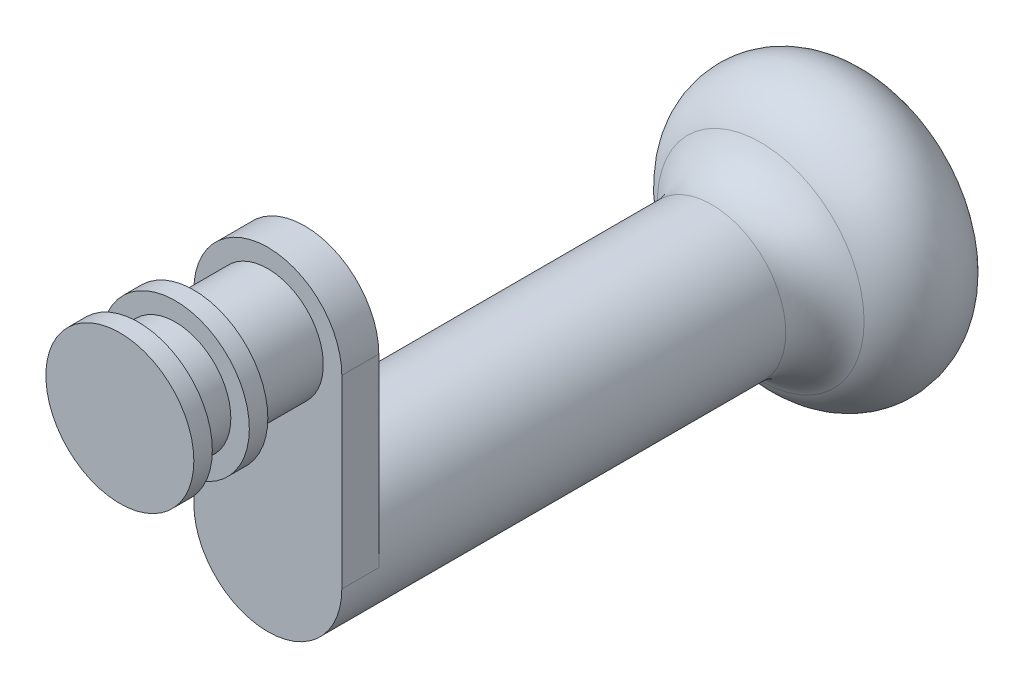
ISO-10303-21;
HEADER;
FILE_DESCRIPTION(('STEP AP214'),'2;1');
FILE_NAME('part.step','',(''),(''),'','','');
FILE_SCHEMA(('AUTOMOTIVE_DESIGN { 1 0 10303 214 1 1 1 1 }'));
ENDSEC;
DATA;
#1=APPLICATION_CONTEXT('core data for automotive mechanical design processes');
#2=APPLICATION_PROTOCOL_DEFINITION('international standard','automotive_design',2000,#1);
#3=PRODUCT_CONTEXT('',#1,'mechanical');
#4=PRODUCT('Part','Part','',(#3));
#5=PRODUCT_RELATED_PRODUCT_CATEGORY('part','',(#4));
#6=PRODUCT_DEFINITION_FORMATION('','',#4);
#7=PRODUCT_DEFINITION_CONTEXT('part definition',#1,'design');
#8=PRODUCT_DEFINITION('design','',#6,#7);
#9=PRODUCT_DEFINITION_SHAPE('','',#8);
#10=(LENGTH_UNIT() NAMED_UNIT(*) SI_UNIT(.MILLI.,.METRE.));
#11=(NAMED_UNIT(*) PLANE_ANGLE_UNIT() SI_UNIT($,.RADIAN.));
#12=(NAMED_UNIT(*) SI_UNIT($,.STERADIAN.) SOLID_ANGLE_UNIT());
#13=UNCERTAINTY_MEASURE_WITH_UNIT(LENGTH_MEASURE(1.E-05),#10,'distance_accuracy_value','');
#14=(GEOMETRIC_REPRESENTATION_CONTEXT(3) GLOBAL_UNCERTAINTY_ASSIGNED_CONTEXT((#13)) GLOBAL_UNIT_ASSIGNED_CONTEXT((#10,
#11,#12)) REPRESENTATION_CONTEXT('',''));
#15=CARTESIAN_POINT('',(0.,0.,0.));
#16=DIRECTION('',(0.,0.,1.));
#17=DIRECTION('',(1.,0.,0.));
#18=AXIS2_PLACEMENT_3D('',#15,#16,#17);
#19=CARTESIAN_POINT('',(0.,0.,25.));
#20=DIRECTION('',(0.,0.,-1.));
#21=DIRECTION('',(-1.,0.,0.));
#22=AXIS2_PLACEMENT_3D('',#19,#20,#21);
#23=CYLINDRICAL_SURFACE('',#22,7.5);
#24=CARTESIAN_POINT('',(0.,0.,15.));
#25=DIRECTION('',(0.,0.,1.));
#26=DIRECTION('',(1.,0.,0.));
#27=AXIS2_PLACEMENT_3D('',#24,#25,#26);
#28=CIRCLE('',#27,7.5);
#29=CARTESIAN_POINT('',(7.5,0.,15.));
#30=VERTEX_POINT('',#29);
#31=EDGE_CURVE('E122',#30,#30,#28,.T.);
#32=ORIENTED_EDGE('',*,*,#31,.F.);
#33=EDGE_LOOP('',(#32));
#34=FACE_BOUND('',#33,.T.);
#35=CARTESIAN_POINT('',(0.,0.,5.));
#36=DIRECTION('',(0.,0.,-1.));
#37=DIRECTION('',(-1.,0.,0.));
#38=AXIS2_PLACEMENT_3D('',#35,#36,#37);
#39=CIRCLE('',#38,7.5);
#40=CARTESIAN_POINT('',(-7.5,0.,5.));
#41=VERTEX_POINT('',#40);
#42=EDGE_CURVE('E41',#41,#41,#39,.T.);
#43=ORIENTED_EDGE('',*,*,#42,.F.);
#44=EDGE_LOOP('',(#43));
#45=FACE_BOUND('',#44,.T.);
#46=ADVANCED_FACE('F32',(#34,#45),#23,.T.);
#47=CARTESIAN_POINT('',(0.,0.,17.5));
#48=DIRECTION('',(0.,0.,1.));
#49=DIRECTION('',(1.,0.,0.));
#50=AXIS2_PLACEMENT_3D('',#47,#48,#49);
#51=CIRCLE('',#50,7.5);
#52=CARTESIAN_POINT('',(7.5,0.,17.5));
#53=VERTEX_POINT('',#52);
#54=EDGE_CURVE('E110',#53,#53,#51,.T.);
#55=ORIENTED_EDGE('',*,*,#54,.T.);
#56=EDGE_LOOP('',(#55));
#57=FACE_BOUND('',#56,.T.);
#58=CARTESIAN_POINT('',(0.,0.,22.5));
#59=DIRECTION('',(0.,0.,1.));
#60=DIRECTION('',(1.,0.,0.));
#61=AXIS2_PLACEMENT_3D('',#58,#59,#60);
#62=CIRCLE('',#61,7.5);
#63=CARTESIAN_POINT('',(7.5,0.,22.5));
#64=VERTEX_POINT('',#63);
#65=EDGE_CURVE('E116',#64,#64,#62,.T.);
#66=ORIENTED_EDGE('',*,*,#65,.F.);
#67=EDGE_LOOP('',(#66));
#68=FACE_BOUND('',#67,.T.);
#69=ADVANCED_FACE('F34',(#57,#68),#23,.T.);
#70=CARTESIAN_POINT('',(0.,0.,22.5));
#71=DIRECTION('',(0.,0.,1.));
#72=DIRECTION('',(1.,0.,0.));
#73=AXIS2_PLACEMENT_3D('',#70,#71,#72);
#74=CYLINDRICAL_SURFACE('',#73,10.);
#75=CARTESIAN_POINT('',(0.,0.,22.5));
#76=DIRECTION('',(0.,0.,1.));
#77=DIRECTION('',(1.,0.,0.));
#78=AXIS2_PLACEMENT_3D('',#75,#76,#77);
#79=CIRCLE('',#78,10.);
#80=CARTESIAN_POINT('',(10.,0.,22.5));
#81=VERTEX_POINT('',#80);
#82=EDGE_CURVE('E113',#81,#81,#79,.T.);
#83=ORIENTED_EDGE('',*,*,#82,.T.);
#84=EDGE_LOOP('',(#83));
#85=FACE_BOUND('',#84,.T.);
#86=CARTESIAN_POINT('',(0.,0.,25.));
#87=DIRECTION('',(0.,0.,1.));
#88=DIRECTION('',(1.,0.,0.));
#89=AXIS2_PLACEMENT_3D('',#86,#87,#88);
#90=CIRCLE('',#89,10.);
#91=CARTESIAN_POINT('',(10.,0.,25.));
#92=VERTEX_POINT('',#91);
#93=EDGE_CURVE('E117',#92,#92,#90,.T.);
#94=ORIENTED_EDGE('',*,*,#93,.F.);
#95=EDGE_LOOP('',(#94));
#96=FACE_BOUND('',#95,.T.);
#97=ADVANCED_FACE('F137',(#85,#96),#74,.T.);
#98=CARTESIAN_POINT('',(0.,0.,22.5));
#99=DIRECTION('',(0.,0.,1.));
#100=DIRECTION('',(1.,0.,0.));
#101=AXIS2_PLACEMENT_3D('',#98,#99,#100);
#102=PLANE('',#101);
#103=ORIENTED_EDGE('',*,*,#65,.T.);
#104=EDGE_LOOP('',(#103));
#105=FACE_BOUND('',#104,.T.);
#106=ORIENTED_EDGE('',*,*,#82,.F.);
#107=EDGE_LOOP('',(#106));
#108=FACE_BOUND('',#107,.T.);
#109=ADVANCED_FACE('F165',(#105,#108),#102,.F.);
#110=CARTESIAN_POINT('',(0.,0.,25.));
#111=DIRECTION('',(0.,0.,1.));
#112=DIRECTION('',(1.,0.,0.));
#113=AXIS2_PLACEMENT_3D('',#110,#111,#112);
#114=PLANE('',#113);
#115=ORIENTED_EDGE('',*,*,#93,.T.);
#116=EDGE_LOOP('',(#115));
#117=FACE_BOUND('',#116,.T.);
#118=ADVANCED_FACE('F151',(#117),#114,.T.);
#119=CARTESIAN_POINT('',(0.,0.,15.));
#120=DIRECTION('',(0.,0.,1.));
#121=DIRECTION('',(1.,0.,0.));
#122=AXIS2_PLACEMENT_3D('',#119,#120,#121);
#123=CYLINDRICAL_SURFACE('',#122,10.);
#124=CARTESIAN_POINT('',(0.,0.,15.));
#125=DIRECTION('',(0.,0.,1.));
#126=DIRECTION('',(1.,0.,0.));
#127=AXIS2_PLACEMENT_3D('',#124,#125,#126);
#128=CIRCLE('',#127,10.);
#129=CARTESIAN_POINT('',(10.,0.,15.));
#130=VERTEX_POINT('',#129);
#131=EDGE_CURVE('E107',#130,#130,#128,.T.);
#132=ORIENTED_EDGE('',*,*,#131,.T.);
#133=EDGE_LOOP('',(#132));
#134=FACE_BOUND('',#133,.T.);
#135=CARTESIAN_POINT('',(0.,0.,17.5));
#136=DIRECTION('',(0.,0.,1.));
#137=DIRECTION('',(1.,0.,0.));
#138=AXIS2_PLACEMENT_3D('',#135,#136,#137);
#139=CIRCLE('',#138,10.);
#140=CARTESIAN_POINT('',(10.,0.,17.5));
#141=VERTEX_POINT('',#140);
#142=EDGE_CURVE('E102',#141,#141,#139,.T.);
#143=ORIENTED_EDGE('',*,*,#142,.F.);
#144=EDGE_LOOP('',(#143));
#145=FACE_BOUND('',#144,.T.);
#146=ADVANCED_FACE('F145',(#134,#145),#123,.T.);
#147=CARTESIAN_POINT('',(0.,0.,15.));
#148=DIRECTION('',(0.,0.,1.));
#149=DIRECTION('',(1.,0.,0.));
#150=AXIS2_PLACEMENT_3D('',#147,#148,#149);
#151=PLANE('',#150);
#152=ORIENTED_EDGE('',*,*,#31,.T.);
#153=EDGE_LOOP('',(#152));
#154=FACE_BOUND('',#153,.T.);
#155=ORIENTED_EDGE('',*,*,#131,.F.);
#156=EDGE_LOOP('',(#155));
#157=FACE_BOUND('',#156,.T.);
#158=ADVANCED_FACE('F141',(#154,#157),#151,.F.);
#159=CARTESIAN_POINT('',(0.,0.,17.5));
#160=DIRECTION('',(0.,0.,1.));
#161=DIRECTION('',(1.,0.,0.));
#162=AXIS2_PLACEMENT_3D('',#159,#160,#161);
#163=PLANE('',#162);
#164=ORIENTED_EDGE('',*,*,#54,.F.);
#165=EDGE_LOOP('',(#164));
#166=FACE_BOUND('',#165,.T.);
#167=ORIENTED_EDGE('',*,*,#142,.T.);
#168=EDGE_LOOP('',(#167));
#169=FACE_BOUND('',#168,.T.);
#170=ADVANCED_FACE('F144',(#166,#169),#163,.T.);
#171=CARTESIAN_POINT('',(0.,0.,5.));
#172=DIRECTION('',(0.,0.,-1.));
#173=DIRECTION('',(-1.,0.,0.));
#174=AXIS2_PLACEMENT_3D('',#171,#172,#173);
#175=CYLINDRICAL_SURFACE('',#174,10.);
#176=CARTESIAN_POINT('',(0.,0.,0.));
#177=DIRECTION('',(0.,0.,-1.));
#178=DIRECTION('',(-1.,0.,0.));
#179=AXIS2_PLACEMENT_3D('',#176,#177,#178);
#180=CIRCLE('',#179,10.);
#181=CARTESIAN_POINT('',(-10.,0.,0.));
#182=VERTEX_POINT('',#181);
#183=CARTESIAN_POINT('',(10.,0.,0.));
#184=VERTEX_POINT('',#183);
#185=EDGE_CURVE('E96',#182,#184,#180,.T.);
#186=ORIENTED_EDGE('',*,*,#185,.F.);
#187=DIRECTION('',(0.,0.,-1.));
#188=VECTOR('',#187,1.);
#189=CARTESIAN_POINT('',(-10.,0.,5.));
#190=LINE('',#189,#188);
#191=CARTESIAN_POINT('',(-10.,0.,5.));
#192=VERTEX_POINT('',#191);
#193=EDGE_CURVE('E49',#192,#182,#190,.T.);
#194=ORIENTED_EDGE('',*,*,#193,.F.);
#195=CARTESIAN_POINT('',(0.,0.,5.));
#196=DIRECTION('',(0.,0.,-1.));
#197=DIRECTION('',(-1.,0.,0.));
#198=AXIS2_PLACEMENT_3D('',#195,#196,#197);
#199=CIRCLE('',#198,10.);
#200=CARTESIAN_POINT('',(10.,0.,5.));
#201=VERTEX_POINT('',#200);
#202=EDGE_CURVE('E84',#192,#201,#199,.T.);
#203=ORIENTED_EDGE('',*,*,#202,.T.);
#204=DIRECTION('',(0.,0.,-1.));
#205=VECTOR('',#204,1.);
#206=CARTESIAN_POINT('',(10.,0.,5.));
#207=LINE('',#206,#205);
#208=EDGE_CURVE('E73',#201,#184,#207,.T.);
#209=ORIENTED_EDGE('',*,*,#208,.T.);
#210=EDGE_LOOP('',(#186,#194,#203,#209));
#211=FACE_BOUND('',#210,.T.);
#212=ADVANCED_FACE('F156',(#211),#175,.T.);
#213=CARTESIAN_POINT('',(-10.,0.,5.));
#214=DIRECTION('',(-1.,0.,0.));
#215=DIRECTION('',(0.,-1.,0.));
#216=AXIS2_PLACEMENT_3D('',#213,#214,#215);
#217=PLANE('',#216);
#218=DIRECTION('',(0.,1.,0.));
#219=VECTOR('',#218,1.);
#220=CARTESIAN_POINT('',(-10.,0.,0.));
#221=LINE('',#220,#219);
#222=CARTESIAN_POINT('',(-10.,-25.,0.));
#223=VERTEX_POINT('',#222);
#224=EDGE_CURVE('E77',#223,#182,#221,.T.);
#225=ORIENTED_EDGE('',*,*,#224,.F.);
#226=DIRECTION('',(0.,0.,-1.));
#227=VECTOR('',#226,1.);
#228=CARTESIAN_POINT('',(-10.,-25.,5.));
#229=LINE('',#228,#227);
#230=CARTESIAN_POINT('',(-10.,-25.,5.));
#231=VERTEX_POINT('',#230);
#232=EDGE_CURVE('E80',#231,#223,#229,.T.);
#233=ORIENTED_EDGE('',*,*,#232,.F.);
#234=DIRECTION('',(0.,1.,0.));
#235=VECTOR('',#234,1.);
#236=CARTESIAN_POINT('',(-10.,0.,5.));
#237=LINE('',#236,#235);
#238=EDGE_CURVE('E106',#231,#192,#237,.T.);
#239=ORIENTED_EDGE('',*,*,#238,.T.);
#240=ORIENTED_EDGE('',*,*,#193,.T.);
#241=EDGE_LOOP('',(#225,#233,#239,#240));
#242=FACE_BOUND('',#241,.T.);
#243=ADVANCED_FACE('F79',(#242),#217,.T.);
#244=CARTESIAN_POINT('',(0.,-25.,5.));
#245=DIRECTION('',(0.,0.,-1.));
#246=DIRECTION('',(-1.,0.,0.));
#247=AXIS2_PLACEMENT_3D('',#244,#245,#246);
#248=CYLINDRICAL_SURFACE('',#247,10.);
#249=ORIENTED_EDGE('',*,*,#232,.T.);
#250=CARTESIAN_POINT('',(0.,-25.,0.));
#251=DIRECTION('',(0.,0.,1.));
#252=DIRECTION('',(1.,0.,0.));
#253=AXIS2_PLACEMENT_3D('',#250,#251,#252);
#254=CIRCLE('',#253,10.);
#255=CARTESIAN_POINT('',(10.,-25.,0.));
#256=VERTEX_POINT('',#255);
#257=EDGE_CURVE('E11',#256,#223,#254,.T.);
#258=ORIENTED_EDGE('',*,*,#257,.F.);
#259=DIRECTION('',(0.,0.,-1.));
#260=VECTOR('',#259,1.);
#261=CARTESIAN_POINT('',(10.,-25.,5.));
#262=LINE('',#261,#260);
#263=CARTESIAN_POINT('',(10.,-25.,5.));
#264=VERTEX_POINT('',#263);
#265=EDGE_CURVE('E65',#264,#256,#262,.T.);
#266=ORIENTED_EDGE('',*,*,#265,.F.);
#267=CARTESIAN_POINT('',(0.,-25.,5.));
#268=DIRECTION('',(0.,0.,-1.));
#269=DIRECTION('',(-1.,0.,0.));
#270=AXIS2_PLACEMENT_3D('',#267,#268,#269);
#271=CIRCLE('',#270,10.);
#272=EDGE_CURVE('E92',#264,#231,#271,.T.);
#273=ORIENTED_EDGE('',*,*,#272,.T.);
#274=EDGE_LOOP('',(#249,#258,#266,#273));
#275=FACE_BOUND('',#274,.T.);
#276=CARTESIAN_POINT('',(0.,-25.,-55.));
#277=DIRECTION('',(0.,0.,1.));
#278=DIRECTION('',(1.,0.,0.));
#279=AXIS2_PLACEMENT_3D('',#276,#277,#278);
#280=CIRCLE('',#279,10.);
#281=CARTESIAN_POINT('',(10.,-25.,-55.));
#282=VERTEX_POINT('',#281);
#283=EDGE_CURVE('E98',#282,#282,#280,.T.);
#284=ORIENTED_EDGE('',*,*,#283,.T.);
#285=EDGE_LOOP('',(#284));
#286=FACE_BOUND('',#285,.T.);
#287=ADVANCED_FACE('F89',(#275,#286),#248,.T.);
#288=CARTESIAN_POINT('',(10.,0.,5.));
#289=DIRECTION('',(1.,0.,0.));
#290=DIRECTION('',(0.,1.,0.));
#291=AXIS2_PLACEMENT_3D('',#288,#289,#290);
#292=PLANE('',#291);
#293=DIRECTION('',(0.,-1.,0.));
#294=VECTOR('',#293,1.);
#295=CARTESIAN_POINT('',(10.,0.,0.));
#296=LINE('',#295,#294);
#297=EDGE_CURVE('E85',#184,#256,#296,.T.);
#298=ORIENTED_EDGE('',*,*,#297,.F.);
#299=ORIENTED_EDGE('',*,*,#208,.F.);
#300=DIRECTION('',(0.,-1.,0.));
#301=VECTOR('',#300,1.);
#302=CARTESIAN_POINT('',(10.,0.,5.));
#303=LINE('',#302,#301);
#304=EDGE_CURVE('E266',#201,#264,#303,.T.);
#305=ORIENTED_EDGE('',*,*,#304,.T.);
#306=ORIENTED_EDGE('',*,*,#265,.T.);
#307=EDGE_LOOP('',(#298,#299,#305,#306));
#308=FACE_BOUND('',#307,.T.);
#309=ADVANCED_FACE('F183',(#308),#292,.T.);
#310=CARTESIAN_POINT('',(0.,0.,5.));
#311=DIRECTION('',(0.,0.,-1.));
#312=DIRECTION('',(-1.,0.,0.));
#313=AXIS2_PLACEMENT_3D('',#310,#311,#312);
#314=PLANE('',#313);
#315=ORIENTED_EDGE('',*,*,#42,.T.);
#316=EDGE_LOOP('',(#315));
#317=FACE_BOUND('',#316,.T.);
#318=ORIENTED_EDGE('',*,*,#238,.F.);
#319=ORIENTED_EDGE('',*,*,#272,.F.);
#320=ORIENTED_EDGE('',*,*,#304,.F.);
#321=ORIENTED_EDGE('',*,*,#202,.F.);
#322=EDGE_LOOP('',(#318,#319,#320,#321));
#323=FACE_BOUND('',#322,.T.);
#324=ADVANCED_FACE('F129',(#317,#323),#314,.F.);
#325=CARTESIAN_POINT('',(0.,0.,0.));
#326=DIRECTION('',(0.,0.,1.));
#327=DIRECTION('',(1.,0.,0.));
#328=AXIS2_PLACEMENT_3D('',#325,#326,#327);
#329=PLANE('',#328);
#330=ORIENTED_EDGE('',*,*,#297,.T.);
#331=ORIENTED_EDGE('',*,*,#257,.T.);
#332=ORIENTED_EDGE('',*,*,#224,.T.);
#333=ORIENTED_EDGE('',*,*,#185,.T.);
#334=EDGE_LOOP('',(#330,#331,#332,#333));
#335=FACE_BOUND('',#334,.T.);
#336=ADVANCED_FACE('F95',(#335),#329,.F.);
#337=CARTESIAN_POINT('',(0.,-25.,-55.));
#338=DIRECTION('',(0.,0.,1.));
#339=DIRECTION('',(1.,0.,0.));
#340=AXIS2_PLACEMENT_3D('',#337,#338,#339);
#341=TOROIDAL_SURFACE('',#340,17.5,7.5);
#342=ORIENTED_EDGE('',*,*,#283,.F.);
#343=EDGE_LOOP('',(#342));
#344=FACE_BOUND('',#343,.T.);
#345=CARTESIAN_POINT('',(0.,-25.,-61.6176470588235));
#346=DIRECTION('',(0.,0.,1.));
#347=DIRECTION('',(1.,0.,0.));
#348=AXIS2_PLACEMENT_3D('',#345,#346,#347);
#349=CIRCLE('',#348,13.9705882352941);
#350=CARTESIAN_POINT('',(13.9705882352941,-25.,-61.6176470588235));
#351=VERTEX_POINT('',#350);
#352=EDGE_CURVE('E258',#351,#351,#349,.T.);
#353=ORIENTED_EDGE('',*,*,#352,.T.);
#354=EDGE_LOOP('',(#353));
#355=FACE_BOUND('',#354,.T.);
#356=ADVANCED_FACE('F175',(#344,#355),#341,.F.);
#357=CARTESIAN_POINT('',(0.,-25.,-69.0625));
#358=DIRECTION('',(0.,0.,1.));
#359=DIRECTION('',(1.,0.,0.));
#360=AXIS2_PLACEMENT_3D('',#357,#358,#359);
#361=TOROIDAL_SURFACE('',#360,10.,8.43750000000001);
#362=ORIENTED_EDGE('',*,*,#352,.F.);
#363=EDGE_LOOP('',(#362));
#364=FACE_BOUND('',#363,.T.);
#365=CARTESIAN_POINT('',(0.,-25.,-77.5));
#366=DIRECTION('',(0.,0.,1.));
#367=DIRECTION('',(1.,0.,0.));
#368=AXIS2_PLACEMENT_3D('',#365,#366,#367);
#369=CIRCLE('',#368,10.);
#370=CARTESIAN_POINT('',(10.,-25.,-77.5));
#371=VERTEX_POINT('',#370);
#372=EDGE_CURVE('E256',#371,#371,#369,.T.);
#373=ORIENTED_EDGE('',*,*,#372,.T.);
#374=EDGE_LOOP('',(#373));
#375=FACE_BOUND('',#374,.T.);
#376=ADVANCED_FACE('F180',(#364,#375),#361,.T.);
#377=CARTESIAN_POINT('',(0.,-15.,-77.5));
#378=DIRECTION('',(0.,0.,1.));
#379=DIRECTION('',(1.,0.,0.));
#380=AXIS2_PLACEMENT_3D('',#377,#378,#379);
#381=PLANE('',#380);
#382=ORIENTED_EDGE('',*,*,#372,.F.);
#383=EDGE_LOOP('',(#382));
#384=FACE_BOUND('',#383,.T.);
#385=ADVANCED_FACE('F241',(#384),#381,.F.);
#386=CLOSED_SHELL('',(#46,#69,#97,#109,#118,#146,#158,#170,#212,#243,#287,#309,#324,#336,#356,
#376,#385));
#387=MANIFOLD_SOLID_BREP('B2',#386);
#388=ADVANCED_BREP_SHAPE_REPRESENTATION('',(#18,#387),#14);
#389=SHAPE_DEFINITION_REPRESENTATION(#9,#388);
ENDSEC;
END-ISO-10303-21;
